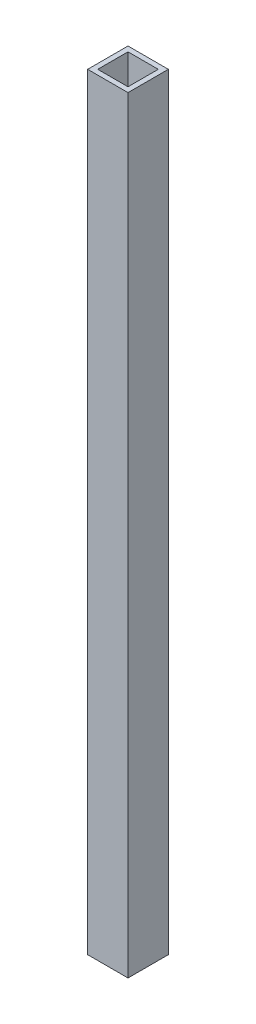
ISO-10303-21;
HEADER;
FILE_DESCRIPTION(('STEP AP214'),'2;1');
FILE_NAME('part.step','',(''),(''),'','','');
FILE_SCHEMA(('AUTOMOTIVE_DESIGN { 1 0 10303 214 1 1 1 1 }'));
ENDSEC;
DATA;
#1=APPLICATION_CONTEXT('core data for automotive mechanical design processes');
#2=APPLICATION_PROTOCOL_DEFINITION('international standard','automotive_design',2000,#1);
#3=PRODUCT_CONTEXT('',#1,'mechanical');
#4=PRODUCT('Part','Part','',(#3));
#5=PRODUCT_RELATED_PRODUCT_CATEGORY('part','',(#4));
#6=PRODUCT_DEFINITION_FORMATION('','',#4);
#7=PRODUCT_DEFINITION_CONTEXT('part definition',#1,'design');
#8=PRODUCT_DEFINITION('design','',#6,#7);
#9=PRODUCT_DEFINITION_SHAPE('','',#8);
#10=(LENGTH_UNIT() NAMED_UNIT(*) SI_UNIT(.MILLI.,.METRE.));
#11=(NAMED_UNIT(*) PLANE_ANGLE_UNIT() SI_UNIT($,.RADIAN.));
#12=(NAMED_UNIT(*) SI_UNIT($,.STERADIAN.) SOLID_ANGLE_UNIT());
#13=UNCERTAINTY_MEASURE_WITH_UNIT(LENGTH_MEASURE(1.E-05),#10,'distance_accuracy_value','');
#14=(GEOMETRIC_REPRESENTATION_CONTEXT(3) GLOBAL_UNCERTAINTY_ASSIGNED_CONTEXT((#13)) GLOBAL_UNIT_ASSIGNED_CONTEXT((#10,
#11,#12)) REPRESENTATION_CONTEXT('',''));
#15=CARTESIAN_POINT('',(0.,0.,0.));
#16=DIRECTION('',(0.,0.,1.));
#17=DIRECTION('',(1.,0.,0.));
#18=AXIS2_PLACEMENT_3D('',#15,#16,#17);
#19=CARTESIAN_POINT('',(-165.1,749.3,2104.59868564606));
#20=DIRECTION('',(-1.,0.,0.));
#21=DIRECTION('',(0.,0.,1.));
#22=AXIS2_PLACEMENT_3D('',#19,#20,#21);
#23=PLANE('',#22);
#24=DIRECTION('',(0.,0.,-1.));
#25=VECTOR('',#24,1.);
#26=CARTESIAN_POINT('',(-165.1,-215.9,2104.59868564606));
#27=LINE('',#26,#25);
#28=CARTESIAN_POINT('',(-165.1,-215.9,2133.6));
#29=VERTEX_POINT('',#28);
#30=CARTESIAN_POINT('',(-165.1,-215.9,2082.8));
#31=VERTEX_POINT('',#30);
#32=EDGE_CURVE('E157',#29,#31,#27,.T.);
#33=ORIENTED_EDGE('',*,*,#32,.T.);
#34=DIRECTION('',(0.,-1.,0.));
#35=VECTOR('',#34,1.);
#36=CARTESIAN_POINT('',(-165.1,749.3,2082.8));
#37=LINE('',#36,#35);
#38=CARTESIAN_POINT('',(-165.1,749.3,2082.8));
#39=VERTEX_POINT('',#38);
#40=EDGE_CURVE('E41',#39,#31,#37,.T.);
#41=ORIENTED_EDGE('',*,*,#40,.F.);
#42=DIRECTION('',(0.,0.,-1.));
#43=VECTOR('',#42,1.);
#44=CARTESIAN_POINT('',(-165.1,749.3,2104.59868564606));
#45=LINE('',#44,#43);
#46=CARTESIAN_POINT('',(-165.1,749.3,2133.6));
#47=VERTEX_POINT('',#46);
#48=EDGE_CURVE('E128',#47,#39,#45,.T.);
#49=ORIENTED_EDGE('',*,*,#48,.F.);
#50=DIRECTION('',(0.,-1.,0.));
#51=VECTOR('',#50,1.);
#52=CARTESIAN_POINT('',(-165.1,749.3,2133.6));
#53=LINE('',#52,#51);
#54=EDGE_CURVE('E11',#47,#29,#53,.T.);
#55=ORIENTED_EDGE('',*,*,#54,.T.);
#56=EDGE_LOOP('',(#33,#41,#49,#55));
#57=FACE_BOUND('',#56,.T.);
#58=ADVANCED_FACE('F16',(#57),#23,.F.);
#59=CARTESIAN_POINT('',(-190.5,749.3,2133.6));
#60=DIRECTION('',(0.,0.,-1.));
#61=DIRECTION('',(-1.,0.,0.));
#62=AXIS2_PLACEMENT_3D('',#59,#60,#61);
#63=PLANE('',#62);
#64=DIRECTION('',(1.,0.,0.));
#65=VECTOR('',#64,1.);
#66=CARTESIAN_POINT('',(-190.5,-215.9,2133.6));
#67=LINE('',#66,#65);
#68=CARTESIAN_POINT('',(-215.9,-215.9,2133.6));
#69=VERTEX_POINT('',#68);
#70=EDGE_CURVE('E160',#69,#29,#67,.T.);
#71=ORIENTED_EDGE('',*,*,#70,.T.);
#72=ORIENTED_EDGE('',*,*,#54,.F.);
#73=DIRECTION('',(1.,0.,0.));
#74=VECTOR('',#73,1.);
#75=CARTESIAN_POINT('',(-190.5,749.3,2133.6));
#76=LINE('',#75,#74);
#77=CARTESIAN_POINT('',(-215.9,749.3,2133.6));
#78=VERTEX_POINT('',#77);
#79=EDGE_CURVE('E123',#78,#47,#76,.T.);
#80=ORIENTED_EDGE('',*,*,#79,.F.);
#81=DIRECTION('',(0.,-1.,0.));
#82=VECTOR('',#81,1.);
#83=CARTESIAN_POINT('',(-215.9,749.3,2133.6));
#84=LINE('',#83,#82);
#85=EDGE_CURVE('E27',#78,#69,#84,.T.);
#86=ORIENTED_EDGE('',*,*,#85,.T.);
#87=EDGE_LOOP('',(#71,#72,#80,#86));
#88=FACE_BOUND('',#87,.T.);
#89=ADVANCED_FACE('F124',(#88),#63,.F.);
#90=CARTESIAN_POINT('',(-215.9,749.3,2104.59868564606));
#91=DIRECTION('',(1.,0.,0.));
#92=DIRECTION('',(0.,0.,-1.));
#93=AXIS2_PLACEMENT_3D('',#90,#91,#92);
#94=PLANE('',#93);
#95=DIRECTION('',(0.,0.,1.));
#96=VECTOR('',#95,1.);
#97=CARTESIAN_POINT('',(-215.9,-215.9,2104.59868564606));
#98=LINE('',#97,#96);
#99=CARTESIAN_POINT('',(-215.9,-215.9,2082.8));
#100=VERTEX_POINT('',#99);
#101=EDGE_CURVE('E116',#100,#69,#98,.T.);
#102=ORIENTED_EDGE('',*,*,#101,.T.);
#103=ORIENTED_EDGE('',*,*,#85,.F.);
#104=DIRECTION('',(0.,0.,1.));
#105=VECTOR('',#104,1.);
#106=CARTESIAN_POINT('',(-215.9,749.3,2104.59868564606));
#107=LINE('',#106,#105);
#108=CARTESIAN_POINT('',(-215.9,749.3,2082.8));
#109=VERTEX_POINT('',#108);
#110=EDGE_CURVE('E113',#109,#78,#107,.T.);
#111=ORIENTED_EDGE('',*,*,#110,.F.);
#112=DIRECTION('',(0.,-1.,0.));
#113=VECTOR('',#112,1.);
#114=CARTESIAN_POINT('',(-215.9,749.3,2082.8));
#115=LINE('',#114,#113);
#116=EDGE_CURVE('E77',#109,#100,#115,.T.);
#117=ORIENTED_EDGE('',*,*,#116,.T.);
#118=EDGE_LOOP('',(#102,#103,#111,#117));
#119=FACE_BOUND('',#118,.T.);
#120=ADVANCED_FACE('F111',(#119),#94,.F.);
#121=CARTESIAN_POINT('',(-188.197001087666,749.3,2089.15));
#122=DIRECTION('',(0.,0.,-1.));
#123=DIRECTION('',(-1.,0.,0.));
#124=AXIS2_PLACEMENT_3D('',#121,#122,#123);
#125=PLANE('',#124);
#126=DIRECTION('',(1.,0.,0.));
#127=VECTOR('',#126,1.);
#128=CARTESIAN_POINT('',(-188.197001087666,-215.9,2089.15));
#129=LINE('',#128,#127);
#130=CARTESIAN_POINT('',(-209.55,-215.9,2089.15));
#131=VERTEX_POINT('',#130);
#132=CARTESIAN_POINT('',(-171.45,-215.9,2089.15));
#133=VERTEX_POINT('',#132);
#134=EDGE_CURVE('E142',#131,#133,#129,.T.);
#135=ORIENTED_EDGE('',*,*,#134,.T.);
#136=DIRECTION('',(0.,-1.,0.));
#137=VECTOR('',#136,1.);
#138=CARTESIAN_POINT('',(-171.45,749.3,2089.15));
#139=LINE('',#138,#137);
#140=CARTESIAN_POINT('',(-171.45,749.3,2089.15));
#141=VERTEX_POINT('',#140);
#142=EDGE_CURVE('E138',#141,#133,#139,.T.);
#143=ORIENTED_EDGE('',*,*,#142,.F.);
#144=DIRECTION('',(1.,0.,0.));
#145=VECTOR('',#144,1.);
#146=CARTESIAN_POINT('',(-188.197001087666,749.3,2089.15));
#147=LINE('',#146,#145);
#148=CARTESIAN_POINT('',(-209.55,749.3,2089.15));
#149=VERTEX_POINT('',#148);
#150=EDGE_CURVE('E166',#149,#141,#147,.T.);
#151=ORIENTED_EDGE('',*,*,#150,.F.);
#152=DIRECTION('',(0.,-1.,0.));
#153=VECTOR('',#152,1.);
#154=CARTESIAN_POINT('',(-209.55,749.3,2089.15));
#155=LINE('',#154,#153);
#156=EDGE_CURVE('E20',#149,#131,#155,.T.);
#157=ORIENTED_EDGE('',*,*,#156,.T.);
#158=EDGE_LOOP('',(#135,#143,#151,#157));
#159=FACE_BOUND('',#158,.T.);
#160=ADVANCED_FACE('F18',(#159),#125,.F.);
#161=CARTESIAN_POINT('',(-209.55,749.3,2107.64241218567));
#162=DIRECTION('',(-1.,0.,0.));
#163=DIRECTION('',(0.,0.,1.));
#164=AXIS2_PLACEMENT_3D('',#161,#162,#163);
#165=PLANE('',#164);
#166=DIRECTION('',(0.,0.,-1.));
#167=VECTOR('',#166,1.);
#168=CARTESIAN_POINT('',(-209.55,-215.9,2107.64241218567));
#169=LINE('',#168,#167);
#170=CARTESIAN_POINT('',(-209.55,-215.9,2127.25));
#171=VERTEX_POINT('',#170);
#172=EDGE_CURVE('E146',#171,#131,#169,.T.);
#173=ORIENTED_EDGE('',*,*,#172,.T.);
#174=ORIENTED_EDGE('',*,*,#156,.F.);
#175=DIRECTION('',(0.,0.,-1.));
#176=VECTOR('',#175,1.);
#177=CARTESIAN_POINT('',(-209.55,749.3,2107.64241218567));
#178=LINE('',#177,#176);
#179=CARTESIAN_POINT('',(-209.55,749.3,2127.25));
#180=VERTEX_POINT('',#179);
#181=EDGE_CURVE('E202',#180,#149,#178,.T.);
#182=ORIENTED_EDGE('',*,*,#181,.F.);
#183=DIRECTION('',(0.,-1.,0.));
#184=VECTOR('',#183,1.);
#185=CARTESIAN_POINT('',(-209.55,749.3,2127.25));
#186=LINE('',#185,#184);
#187=EDGE_CURVE('E175',#180,#171,#186,.T.);
#188=ORIENTED_EDGE('',*,*,#187,.T.);
#189=EDGE_LOOP('',(#173,#174,#182,#188));
#190=FACE_BOUND('',#189,.T.);
#191=ADVANCED_FACE('F186',(#190),#165,.F.);
#192=CARTESIAN_POINT('',(-188.197001087666,749.3,2127.25));
#193=DIRECTION('',(0.,0.,-1.));
#194=DIRECTION('',(-1.,0.,0.));
#195=AXIS2_PLACEMENT_3D('',#192,#193,#194);
#196=PLANE('',#195);
#197=DIRECTION('',(1.,0.,0.));
#198=VECTOR('',#197,1.);
#199=CARTESIAN_POINT('',(-188.197001087666,-215.9,2127.25));
#200=LINE('',#199,#198);
#201=CARTESIAN_POINT('',(-171.45,-215.9,2127.25));
#202=VERTEX_POINT('',#201);
#203=EDGE_CURVE('E149',#171,#202,#200,.T.);
#204=ORIENTED_EDGE('',*,*,#203,.F.);
#205=ORIENTED_EDGE('',*,*,#187,.F.);
#206=DIRECTION('',(1.,0.,0.));
#207=VECTOR('',#206,1.);
#208=CARTESIAN_POINT('',(-188.197001087666,749.3,2127.25));
#209=LINE('',#208,#207);
#210=CARTESIAN_POINT('',(-171.45,749.3,2127.25));
#211=VERTEX_POINT('',#210);
#212=EDGE_CURVE('E200',#180,#211,#209,.T.);
#213=ORIENTED_EDGE('',*,*,#212,.T.);
#214=DIRECTION('',(0.,-1.,0.));
#215=VECTOR('',#214,1.);
#216=CARTESIAN_POINT('',(-171.45,749.3,2127.25));
#217=LINE('',#216,#215);
#218=EDGE_CURVE('E173',#211,#202,#217,.T.);
#219=ORIENTED_EDGE('',*,*,#218,.T.);
#220=EDGE_LOOP('',(#204,#205,#213,#219));
#221=FACE_BOUND('',#220,.T.);
#222=ADVANCED_FACE('F222',(#221),#196,.T.);
#223=CARTESIAN_POINT('',(-171.45,749.3,2107.64241218567));
#224=DIRECTION('',(-1.,0.,0.));
#225=DIRECTION('',(0.,0.,1.));
#226=AXIS2_PLACEMENT_3D('',#223,#224,#225);
#227=PLANE('',#226);
#228=DIRECTION('',(0.,0.,-1.));
#229=VECTOR('',#228,1.);
#230=CARTESIAN_POINT('',(-171.45,-215.9,2107.64241218567));
#231=LINE('',#230,#229);
#232=EDGE_CURVE('E153',#202,#133,#231,.T.);
#233=ORIENTED_EDGE('',*,*,#232,.F.);
#234=ORIENTED_EDGE('',*,*,#218,.F.);
#235=DIRECTION('',(0.,0.,-1.));
#236=VECTOR('',#235,1.);
#237=CARTESIAN_POINT('',(-171.45,749.3,2107.64241218567));
#238=LINE('',#237,#236);
#239=EDGE_CURVE('E196',#211,#141,#238,.T.);
#240=ORIENTED_EDGE('',*,*,#239,.T.);
#241=ORIENTED_EDGE('',*,*,#142,.T.);
#242=EDGE_LOOP('',(#233,#234,#240,#241));
#243=FACE_BOUND('',#242,.T.);
#244=ADVANCED_FACE('F192',(#243),#227,.T.);
#245=CARTESIAN_POINT('',(-190.5,749.3,2082.8));
#246=DIRECTION('',(0.,0.,-1.));
#247=DIRECTION('',(-1.,0.,0.));
#248=AXIS2_PLACEMENT_3D('',#245,#246,#247);
#249=PLANE('',#248);
#250=DIRECTION('',(1.,0.,0.));
#251=VECTOR('',#250,1.);
#252=CARTESIAN_POINT('',(-190.5,-215.9,2082.8));
#253=LINE('',#252,#251);
#254=EDGE_CURVE('E163',#100,#31,#253,.T.);
#255=ORIENTED_EDGE('',*,*,#254,.F.);
#256=ORIENTED_EDGE('',*,*,#116,.F.);
#257=DIRECTION('',(1.,0.,0.));
#258=VECTOR('',#257,1.);
#259=CARTESIAN_POINT('',(-190.5,749.3,2082.8));
#260=LINE('',#259,#258);
#261=EDGE_CURVE('E131',#109,#39,#260,.T.);
#262=ORIENTED_EDGE('',*,*,#261,.T.);
#263=ORIENTED_EDGE('',*,*,#40,.T.);
#264=EDGE_LOOP('',(#255,#256,#262,#263));
#265=FACE_BOUND('',#264,.T.);
#266=ADVANCED_FACE('F213',(#265),#249,.T.);
#267=CARTESIAN_POINT('',(-190.5,749.3,1066.8));
#268=DIRECTION('',(0.,-1.,0.));
#269=DIRECTION('',(1.,0.,0.));
#270=AXIS2_PLACEMENT_3D('',#267,#268,#269);
#271=PLANE('',#270);
#272=ORIENTED_EDGE('',*,*,#150,.T.);
#273=ORIENTED_EDGE('',*,*,#239,.F.);
#274=ORIENTED_EDGE('',*,*,#212,.F.);
#275=ORIENTED_EDGE('',*,*,#181,.T.);
#276=EDGE_LOOP('',(#272,#273,#274,#275));
#277=FACE_BOUND('',#276,.T.);
#278=ORIENTED_EDGE('',*,*,#48,.T.);
#279=ORIENTED_EDGE('',*,*,#261,.F.);
#280=ORIENTED_EDGE('',*,*,#110,.T.);
#281=ORIENTED_EDGE('',*,*,#79,.T.);
#282=EDGE_LOOP('',(#278,#279,#280,#281));
#283=FACE_BOUND('',#282,.T.);
#284=ADVANCED_FACE('F130',(#277,#283),#271,.F.);
#285=CARTESIAN_POINT('',(-190.5,-215.9,1066.8));
#286=DIRECTION('',(0.,-1.,0.));
#287=DIRECTION('',(1.,0.,0.));
#288=AXIS2_PLACEMENT_3D('',#285,#286,#287);
#289=PLANE('',#288);
#290=ORIENTED_EDGE('',*,*,#134,.F.);
#291=ORIENTED_EDGE('',*,*,#172,.F.);
#292=ORIENTED_EDGE('',*,*,#203,.T.);
#293=ORIENTED_EDGE('',*,*,#232,.T.);
#294=EDGE_LOOP('',(#290,#291,#292,#293));
#295=FACE_BOUND('',#294,.T.);
#296=ORIENTED_EDGE('',*,*,#32,.F.);
#297=ORIENTED_EDGE('',*,*,#70,.F.);
#298=ORIENTED_EDGE('',*,*,#101,.F.);
#299=ORIENTED_EDGE('',*,*,#254,.T.);
#300=EDGE_LOOP('',(#296,#297,#298,#299));
#301=FACE_BOUND('',#300,.T.);
#302=ADVANCED_FACE('F188',(#295,#301),#289,.T.);
#303=CLOSED_SHELL('',(#58,#89,#120,#160,#191,#222,#244,#266,#284,#302));
#304=MANIFOLD_SOLID_BREP('B1',#303);
#305=ADVANCED_BREP_SHAPE_REPRESENTATION('',(#18,#304),#14);
#306=SHAPE_DEFINITION_REPRESENTATION(#9,#305);
ENDSEC;
END-ISO-10303-21;
